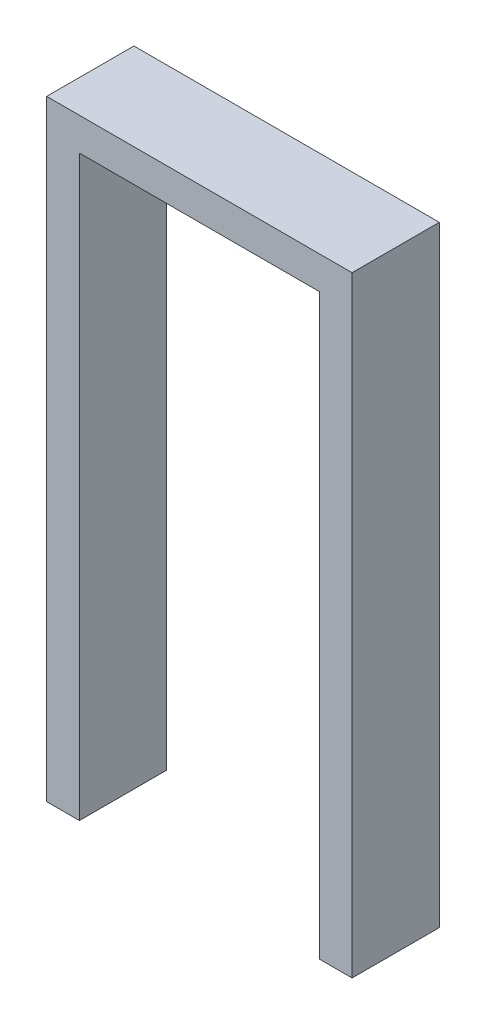
ISO-10303-21;
HEADER;
FILE_DESCRIPTION(('STEP AP214'),'2;1');
FILE_NAME('part.step','',(''),(''),'','','');
FILE_SCHEMA(('AUTOMOTIVE_DESIGN { 1 0 10303 214 1 1 1 1 }'));
ENDSEC;
DATA;
#1=APPLICATION_CONTEXT('core data for automotive mechanical design processes');
#2=APPLICATION_PROTOCOL_DEFINITION('international standard','automotive_design',2000,#1);
#3=PRODUCT_CONTEXT('',#1,'mechanical');
#4=PRODUCT('Part','Part','',(#3));
#5=PRODUCT_RELATED_PRODUCT_CATEGORY('part','',(#4));
#6=PRODUCT_DEFINITION_FORMATION('','',#4);
#7=PRODUCT_DEFINITION_CONTEXT('part definition',#1,'design');
#8=PRODUCT_DEFINITION('design','',#6,#7);
#9=PRODUCT_DEFINITION_SHAPE('','',#8);
#10=(LENGTH_UNIT() NAMED_UNIT(*) SI_UNIT(.MILLI.,.METRE.));
#11=(NAMED_UNIT(*) PLANE_ANGLE_UNIT() SI_UNIT($,.RADIAN.));
#12=(NAMED_UNIT(*) SI_UNIT($,.STERADIAN.) SOLID_ANGLE_UNIT());
#13=UNCERTAINTY_MEASURE_WITH_UNIT(LENGTH_MEASURE(1.E-05),#10,'distance_accuracy_value','');
#14=(GEOMETRIC_REPRESENTATION_CONTEXT(3) GLOBAL_UNCERTAINTY_ASSIGNED_CONTEXT((#13)) GLOBAL_UNIT_ASSIGNED_CONTEXT((#10,
#11,#12)) REPRESENTATION_CONTEXT('',''));
#15=CARTESIAN_POINT('',(0.,0.,0.));
#16=DIRECTION('',(0.,0.,1.));
#17=DIRECTION('',(1.,0.,0.));
#18=AXIS2_PLACEMENT_3D('',#15,#16,#17);
#19=CARTESIAN_POINT('',(0.,-673.1,101.6));
#20=DIRECTION('',(0.,-1.,0.));
#21=DIRECTION('',(0.,0.,-1.));
#22=AXIS2_PLACEMENT_3D('',#19,#20,#21);
#23=PLANE('',#22);
#24=DIRECTION('',(-1.,0.,0.));
#25=VECTOR('',#24,1.);
#26=CARTESIAN_POINT('',(0.,-673.1,0.));
#27=LINE('',#26,#25);
#28=CARTESIAN_POINT('',(317.5,-673.1,0.));
#29=VERTEX_POINT('',#28);
#30=CARTESIAN_POINT('',(279.4,-673.1,0.));
#31=VERTEX_POINT('',#30);
#32=EDGE_CURVE('E132',#29,#31,#27,.T.);
#33=ORIENTED_EDGE('',*,*,#32,.F.);
#34=DIRECTION('',(0.,0.,-1.));
#35=VECTOR('',#34,1.);
#36=CARTESIAN_POINT('',(317.5,-673.1,101.6));
#37=LINE('',#36,#35);
#38=CARTESIAN_POINT('',(317.5,-673.1,101.6));
#39=VERTEX_POINT('',#38);
#40=EDGE_CURVE('E11',#39,#29,#37,.T.);
#41=ORIENTED_EDGE('',*,*,#40,.F.);
#42=DIRECTION('',(-1.,0.,0.));
#43=VECTOR('',#42,1.);
#44=CARTESIAN_POINT('',(0.,-673.1,101.6));
#45=LINE('',#44,#43);
#46=CARTESIAN_POINT('',(279.4,-673.1,101.6));
#47=VERTEX_POINT('',#46);
#48=EDGE_CURVE('E150',#39,#47,#45,.T.);
#49=ORIENTED_EDGE('',*,*,#48,.T.);
#50=DIRECTION('',(0.,0.,-1.));
#51=VECTOR('',#50,1.);
#52=CARTESIAN_POINT('',(279.4,-673.1,101.6));
#53=LINE('',#52,#51);
#54=EDGE_CURVE('E89',#47,#31,#53,.T.);
#55=ORIENTED_EDGE('',*,*,#54,.T.);
#56=EDGE_LOOP('',(#33,#41,#49,#55));
#57=FACE_BOUND('',#56,.T.);
#58=ADVANCED_FACE('F39',(#57),#23,.T.);
#59=CARTESIAN_POINT('',(317.5,0.,101.6));
#60=DIRECTION('',(1.,0.,0.));
#61=DIRECTION('',(0.,0.,-1.));
#62=AXIS2_PLACEMENT_3D('',#59,#60,#61);
#63=PLANE('',#62);
#64=DIRECTION('',(0.,-1.,0.));
#65=VECTOR('',#64,1.);
#66=CARTESIAN_POINT('',(317.5,0.,0.));
#67=LINE('',#66,#65);
#68=CARTESIAN_POINT('',(317.5,38.1,0.));
#69=VERTEX_POINT('',#68);
#70=EDGE_CURVE('E135',#69,#29,#67,.T.);
#71=ORIENTED_EDGE('',*,*,#70,.F.);
#72=DIRECTION('',(0.,0.,-1.));
#73=VECTOR('',#72,1.);
#74=CARTESIAN_POINT('',(317.5,38.1,101.6));
#75=LINE('',#74,#73);
#76=CARTESIAN_POINT('',(317.5,38.1,101.6));
#77=VERTEX_POINT('',#76);
#78=EDGE_CURVE('E47',#77,#69,#75,.T.);
#79=ORIENTED_EDGE('',*,*,#78,.F.);
#80=DIRECTION('',(0.,-1.,0.));
#81=VECTOR('',#80,1.);
#82=CARTESIAN_POINT('',(317.5,0.,101.6));
#83=LINE('',#82,#81);
#84=EDGE_CURVE('E182',#77,#39,#83,.T.);
#85=ORIENTED_EDGE('',*,*,#84,.T.);
#86=ORIENTED_EDGE('',*,*,#40,.T.);
#87=EDGE_LOOP('',(#71,#79,#85,#86));
#88=FACE_BOUND('',#87,.T.);
#89=ADVANCED_FACE('F168',(#88),#63,.T.);
#90=CARTESIAN_POINT('',(0.,38.1,101.6));
#91=DIRECTION('',(0.,1.,0.));
#92=DIRECTION('',(0.,0.,1.));
#93=AXIS2_PLACEMENT_3D('',#90,#91,#92);
#94=PLANE('',#93);
#95=DIRECTION('',(1.,0.,0.));
#96=VECTOR('',#95,1.);
#97=CARTESIAN_POINT('',(0.,38.1,0.));
#98=LINE('',#97,#96);
#99=CARTESIAN_POINT('',(-38.1,38.1,0.));
#100=VERTEX_POINT('',#99);
#101=EDGE_CURVE('E138',#100,#69,#98,.T.);
#102=ORIENTED_EDGE('',*,*,#101,.F.);
#103=DIRECTION('',(0.,0.,-1.));
#104=VECTOR('',#103,1.);
#105=CARTESIAN_POINT('',(-38.1,38.1,101.6));
#106=LINE('',#105,#104);
#107=CARTESIAN_POINT('',(-38.1,38.1,101.6));
#108=VERTEX_POINT('',#107);
#109=EDGE_CURVE('E157',#108,#100,#106,.T.);
#110=ORIENTED_EDGE('',*,*,#109,.F.);
#111=DIRECTION('',(1.,0.,0.));
#112=VECTOR('',#111,1.);
#113=CARTESIAN_POINT('',(0.,38.1,101.6));
#114=LINE('',#113,#112);
#115=EDGE_CURVE('E164',#108,#77,#114,.T.);
#116=ORIENTED_EDGE('',*,*,#115,.T.);
#117=ORIENTED_EDGE('',*,*,#78,.T.);
#118=EDGE_LOOP('',(#102,#110,#116,#117));
#119=FACE_BOUND('',#118,.T.);
#120=ADVANCED_FACE('F162',(#119),#94,.T.);
#121=CARTESIAN_POINT('',(-38.1,0.,101.6));
#122=DIRECTION('',(1.,0.,0.));
#123=DIRECTION('',(0.,0.,-1.));
#124=AXIS2_PLACEMENT_3D('',#121,#122,#123);
#125=PLANE('',#124);
#126=DIRECTION('',(0.,-1.,0.));
#127=VECTOR('',#126,1.);
#128=CARTESIAN_POINT('',(-38.1,0.,0.));
#129=LINE('',#128,#127);
#130=CARTESIAN_POINT('',(-38.1,-673.1,0.));
#131=VERTEX_POINT('',#130);
#132=EDGE_CURVE('E141',#100,#131,#129,.T.);
#133=ORIENTED_EDGE('',*,*,#132,.T.);
#134=DIRECTION('',(0.,0.,-1.));
#135=VECTOR('',#134,1.);
#136=CARTESIAN_POINT('',(-38.1,-673.1,101.6));
#137=LINE('',#136,#135);
#138=CARTESIAN_POINT('',(-38.1,-673.1,101.6));
#139=VERTEX_POINT('',#138);
#140=EDGE_CURVE('E154',#139,#131,#137,.T.);
#141=ORIENTED_EDGE('',*,*,#140,.F.);
#142=DIRECTION('',(0.,-1.,0.));
#143=VECTOR('',#142,1.);
#144=CARTESIAN_POINT('',(-38.1,0.,101.6));
#145=LINE('',#144,#143);
#146=EDGE_CURVE('E127',#108,#139,#145,.T.);
#147=ORIENTED_EDGE('',*,*,#146,.F.);
#148=ORIENTED_EDGE('',*,*,#109,.T.);
#149=EDGE_LOOP('',(#133,#141,#147,#148));
#150=FACE_BOUND('',#149,.T.);
#151=ADVANCED_FACE('F175',(#150),#125,.F.);
#152=CARTESIAN_POINT('',(0.,-673.1,101.6));
#153=DIRECTION('',(0.,1.,0.));
#154=DIRECTION('',(0.,0.,1.));
#155=AXIS2_PLACEMENT_3D('',#152,#153,#154);
#156=PLANE('',#155);
#157=DIRECTION('',(1.,0.,0.));
#158=VECTOR('',#157,1.);
#159=CARTESIAN_POINT('',(0.,-673.1,0.));
#160=LINE('',#159,#158);
#161=CARTESIAN_POINT('',(0.,-673.1,0.));
#162=VERTEX_POINT('',#161);
#163=EDGE_CURVE('E143',#131,#162,#160,.T.);
#164=ORIENTED_EDGE('',*,*,#163,.T.);
#165=DIRECTION('',(0.,0.,-1.));
#166=VECTOR('',#165,1.);
#167=CARTESIAN_POINT('',(0.,-673.1,101.6));
#168=LINE('',#167,#166);
#169=CARTESIAN_POINT('',(0.,-673.1,101.6));
#170=VERTEX_POINT('',#169);
#171=EDGE_CURVE('E116',#170,#162,#168,.T.);
#172=ORIENTED_EDGE('',*,*,#171,.F.);
#173=DIRECTION('',(1.,0.,0.));
#174=VECTOR('',#173,1.);
#175=CARTESIAN_POINT('',(0.,-673.1,101.6));
#176=LINE('',#175,#174);
#177=EDGE_CURVE('E124',#139,#170,#176,.T.);
#178=ORIENTED_EDGE('',*,*,#177,.F.);
#179=ORIENTED_EDGE('',*,*,#140,.T.);
#180=EDGE_LOOP('',(#164,#172,#178,#179));
#181=FACE_BOUND('',#180,.T.);
#182=ADVANCED_FACE('F178',(#181),#156,.F.);
#183=CARTESIAN_POINT('',(0.,0.,101.6));
#184=DIRECTION('',(1.,0.,0.));
#185=DIRECTION('',(0.,1.,0.));
#186=AXIS2_PLACEMENT_3D('',#183,#184,#185);
#187=PLANE('',#186);
#188=DIRECTION('',(0.,-1.,0.));
#189=VECTOR('',#188,1.);
#190=CARTESIAN_POINT('',(0.,0.,0.));
#191=LINE('',#190,#189);
#192=CARTESIAN_POINT('',(0.,0.,0.));
#193=VERTEX_POINT('',#192);
#194=EDGE_CURVE('E115',#193,#162,#191,.T.);
#195=ORIENTED_EDGE('',*,*,#194,.F.);
#196=DIRECTION('',(0.,0.,-1.));
#197=VECTOR('',#196,1.);
#198=CARTESIAN_POINT('',(0.,0.,101.6));
#199=LINE('',#198,#197);
#200=CARTESIAN_POINT('',(0.,0.,101.6));
#201=VERTEX_POINT('',#200);
#202=EDGE_CURVE('E109',#201,#193,#199,.T.);
#203=ORIENTED_EDGE('',*,*,#202,.F.);
#204=DIRECTION('',(0.,-1.,0.));
#205=VECTOR('',#204,1.);
#206=CARTESIAN_POINT('',(0.,0.,101.6));
#207=LINE('',#206,#205);
#208=EDGE_CURVE('E113',#201,#170,#207,.T.);
#209=ORIENTED_EDGE('',*,*,#208,.T.);
#210=ORIENTED_EDGE('',*,*,#171,.T.);
#211=EDGE_LOOP('',(#195,#203,#209,#210));
#212=FACE_BOUND('',#211,.T.);
#213=ADVANCED_FACE('F111',(#212),#187,.T.);
#214=CARTESIAN_POINT('',(0.,0.,101.6));
#215=DIRECTION('',(0.,1.,0.));
#216=DIRECTION('',(0.,0.,1.));
#217=AXIS2_PLACEMENT_3D('',#214,#215,#216);
#218=PLANE('',#217);
#219=DIRECTION('',(1.,0.,0.));
#220=VECTOR('',#219,1.);
#221=CARTESIAN_POINT('',(0.,0.,0.));
#222=LINE('',#221,#220);
#223=CARTESIAN_POINT('',(279.4,0.,0.));
#224=VERTEX_POINT('',#223);
#225=EDGE_CURVE('E82',#193,#224,#222,.T.);
#226=ORIENTED_EDGE('',*,*,#225,.T.);
#227=DIRECTION('',(0.,0.,-1.));
#228=VECTOR('',#227,1.);
#229=CARTESIAN_POINT('',(279.4,0.,101.6));
#230=LINE('',#229,#228);
#231=CARTESIAN_POINT('',(279.4,0.,101.6));
#232=VERTEX_POINT('',#231);
#233=EDGE_CURVE('E117',#232,#224,#230,.T.);
#234=ORIENTED_EDGE('',*,*,#233,.F.);
#235=DIRECTION('',(1.,0.,0.));
#236=VECTOR('',#235,1.);
#237=CARTESIAN_POINT('',(0.,0.,101.6));
#238=LINE('',#237,#236);
#239=EDGE_CURVE('E119',#201,#232,#238,.T.);
#240=ORIENTED_EDGE('',*,*,#239,.F.);
#241=ORIENTED_EDGE('',*,*,#202,.T.);
#242=EDGE_LOOP('',(#226,#234,#240,#241));
#243=FACE_BOUND('',#242,.T.);
#244=ADVANCED_FACE('F120',(#243),#218,.F.);
#245=CARTESIAN_POINT('',(279.4,0.,101.6));
#246=DIRECTION('',(1.,0.,0.));
#247=DIRECTION('',(0.,0.,-1.));
#248=AXIS2_PLACEMENT_3D('',#245,#246,#247);
#249=PLANE('',#248);
#250=DIRECTION('',(0.,-1.,0.));
#251=VECTOR('',#250,1.);
#252=CARTESIAN_POINT('',(279.4,0.,0.));
#253=LINE('',#252,#251);
#254=EDGE_CURVE('E148',#224,#31,#253,.T.);
#255=ORIENTED_EDGE('',*,*,#254,.T.);
#256=ORIENTED_EDGE('',*,*,#54,.F.);
#257=DIRECTION('',(0.,-1.,0.));
#258=VECTOR('',#257,1.);
#259=CARTESIAN_POINT('',(279.4,0.,101.6));
#260=LINE('',#259,#258);
#261=EDGE_CURVE('E55',#232,#47,#260,.T.);
#262=ORIENTED_EDGE('',*,*,#261,.F.);
#263=ORIENTED_EDGE('',*,*,#233,.T.);
#264=EDGE_LOOP('',(#255,#256,#262,#263));
#265=FACE_BOUND('',#264,.T.);
#266=ADVANCED_FACE('F181',(#265),#249,.F.);
#267=CARTESIAN_POINT('',(0.,0.,101.6));
#268=DIRECTION('',(0.,0.,1.));
#269=DIRECTION('',(1.,0.,0.));
#270=AXIS2_PLACEMENT_3D('',#267,#268,#269);
#271=PLANE('',#270);
#272=ORIENTED_EDGE('',*,*,#48,.F.);
#273=ORIENTED_EDGE('',*,*,#84,.F.);
#274=ORIENTED_EDGE('',*,*,#115,.F.);
#275=ORIENTED_EDGE('',*,*,#146,.T.);
#276=ORIENTED_EDGE('',*,*,#177,.T.);
#277=ORIENTED_EDGE('',*,*,#208,.F.);
#278=ORIENTED_EDGE('',*,*,#239,.T.);
#279=ORIENTED_EDGE('',*,*,#261,.T.);
#280=EDGE_LOOP('',(#272,#273,#274,#275,#276,#277,#278,#279));
#281=FACE_BOUND('',#280,.T.);
#282=ADVANCED_FACE('F122',(#281),#271,.T.);
#283=CARTESIAN_POINT('',(0.,0.,0.));
#284=DIRECTION('',(0.,0.,1.));
#285=DIRECTION('',(1.,0.,0.));
#286=AXIS2_PLACEMENT_3D('',#283,#284,#285);
#287=PLANE('',#286);
#288=ORIENTED_EDGE('',*,*,#32,.T.);
#289=ORIENTED_EDGE('',*,*,#254,.F.);
#290=ORIENTED_EDGE('',*,*,#225,.F.);
#291=ORIENTED_EDGE('',*,*,#194,.T.);
#292=ORIENTED_EDGE('',*,*,#163,.F.);
#293=ORIENTED_EDGE('',*,*,#132,.F.);
#294=ORIENTED_EDGE('',*,*,#101,.T.);
#295=ORIENTED_EDGE('',*,*,#70,.T.);
#296=EDGE_LOOP('',(#288,#289,#290,#291,#292,#293,#294,#295));
#297=FACE_BOUND('',#296,.T.);
#298=ADVANCED_FACE('F171',(#297),#287,.F.);
#299=CLOSED_SHELL('',(#58,#89,#120,#151,#182,#213,#244,#266,#282,#298));
#300=MANIFOLD_SOLID_BREP('B2',#299);
#301=ADVANCED_BREP_SHAPE_REPRESENTATION('',(#18,#300),#14);
#302=SHAPE_DEFINITION_REPRESENTATION(#9,#301);
ENDSEC;
END-ISO-10303-21;
